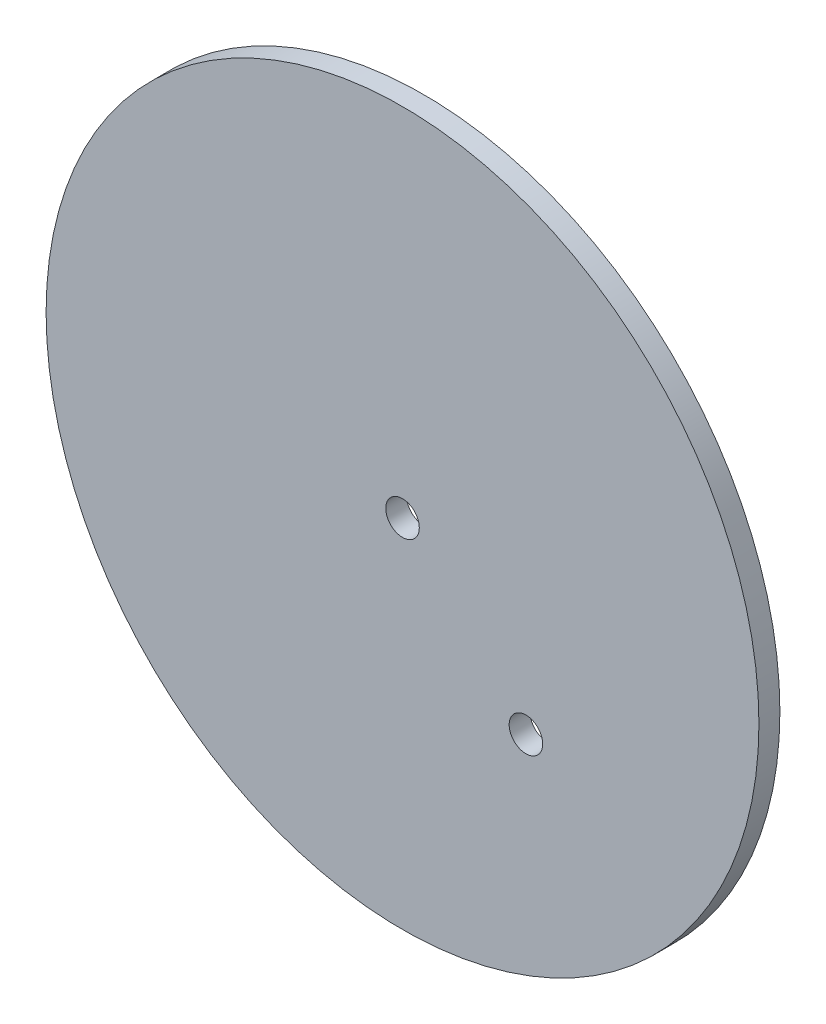
ISO-10303-21;
HEADER;
FILE_DESCRIPTION(('STEP AP214'),'2;1');
FILE_NAME('part.step','',(''),(''),'','','');
FILE_SCHEMA(('AUTOMOTIVE_DESIGN { 1 0 10303 214 1 1 1 1 }'));
ENDSEC;
DATA;
#1=APPLICATION_CONTEXT('core data for automotive mechanical design processes');
#2=APPLICATION_PROTOCOL_DEFINITION('international standard','automotive_design',2000,#1);
#3=PRODUCT_CONTEXT('',#1,'mechanical');
#4=PRODUCT('Part','Part','',(#3));
#5=PRODUCT_RELATED_PRODUCT_CATEGORY('part','',(#4));
#6=PRODUCT_DEFINITION_FORMATION('','',#4);
#7=PRODUCT_DEFINITION_CONTEXT('part definition',#1,'design');
#8=PRODUCT_DEFINITION('design','',#6,#7);
#9=PRODUCT_DEFINITION_SHAPE('','',#8);
#10=(LENGTH_UNIT() NAMED_UNIT(*) SI_UNIT(.MILLI.,.METRE.));
#11=(NAMED_UNIT(*) PLANE_ANGLE_UNIT() SI_UNIT($,.RADIAN.));
#12=(NAMED_UNIT(*) SI_UNIT($,.STERADIAN.) SOLID_ANGLE_UNIT());
#13=UNCERTAINTY_MEASURE_WITH_UNIT(LENGTH_MEASURE(1.E-05),#10,'distance_accuracy_value','');
#14=(GEOMETRIC_REPRESENTATION_CONTEXT(3) GLOBAL_UNCERTAINTY_ASSIGNED_CONTEXT((#13)) GLOBAL_UNIT_ASSIGNED_CONTEXT((#10,
#11,#12)) REPRESENTATION_CONTEXT('',''));
#15=CARTESIAN_POINT('',(0.,0.,0.));
#16=DIRECTION('',(0.,0.,1.));
#17=DIRECTION('',(1.,0.,0.));
#18=AXIS2_PLACEMENT_3D('',#15,#16,#17);
#19=CARTESIAN_POINT('',(0.,0.,-1.25));
#20=DIRECTION('',(0.,0.,1.));
#21=DIRECTION('',(1.,0.,0.));
#22=AXIS2_PLACEMENT_3D('',#19,#20,#21);
#23=CYLINDRICAL_SURFACE('',#22,2.);
#24=CARTESIAN_POINT('',(0.,0.,-1.25));
#25=DIRECTION('',(0.,0.,1.));
#26=DIRECTION('',(1.,0.,0.));
#27=AXIS2_PLACEMENT_3D('',#24,#25,#26);
#28=CIRCLE('',#27,2.);
#29=CARTESIAN_POINT('',(2.,0.,-1.25));
#30=VERTEX_POINT('',#29);
#31=EDGE_CURVE('E43',#30,#30,#28,.T.);
#32=ORIENTED_EDGE('',*,*,#31,.F.);
#33=EDGE_LOOP('',(#32));
#34=FACE_BOUND('',#33,.T.);
#35=CARTESIAN_POINT('',(0.,0.,1.25));
#36=DIRECTION('',(0.,0.,1.));
#37=DIRECTION('',(1.,0.,0.));
#38=AXIS2_PLACEMENT_3D('',#35,#36,#37);
#39=CIRCLE('',#38,2.);
#40=CARTESIAN_POINT('',(2.,0.,1.25));
#41=VERTEX_POINT('',#40);
#42=EDGE_CURVE('E56',#41,#41,#39,.T.);
#43=ORIENTED_EDGE('',*,*,#42,.T.);
#44=EDGE_LOOP('',(#43));
#45=FACE_BOUND('',#44,.T.);
#46=ADVANCED_FACE('F36',(#34,#45),#23,.F.);
#47=CARTESIAN_POINT('',(14.7158150511627,-14.9814814814815,-1.25));
#48=DIRECTION('',(0.,0.,1.));
#49=DIRECTION('',(1.,0.,0.));
#50=AXIS2_PLACEMENT_3D('',#47,#48,#49);
#51=CYLINDRICAL_SURFACE('',#50,2.);
#52=CARTESIAN_POINT('',(14.7158150511627,-14.9814814814815,-1.25));
#53=DIRECTION('',(0.,0.,1.));
#54=DIRECTION('',(1.,0.,0.));
#55=AXIS2_PLACEMENT_3D('',#52,#53,#54);
#56=CIRCLE('',#55,2.);
#57=CARTESIAN_POINT('',(16.7158150511627,-14.9814814814815,-1.25));
#58=VERTEX_POINT('',#57);
#59=EDGE_CURVE('E47',#58,#58,#56,.T.);
#60=ORIENTED_EDGE('',*,*,#59,.F.);
#61=EDGE_LOOP('',(#60));
#62=FACE_BOUND('',#61,.T.);
#63=CARTESIAN_POINT('',(14.7158150511627,-14.9814814814815,1.25));
#64=DIRECTION('',(0.,0.,1.));
#65=DIRECTION('',(1.,0.,0.));
#66=AXIS2_PLACEMENT_3D('',#63,#64,#65);
#67=CIRCLE('',#66,2.);
#68=CARTESIAN_POINT('',(16.7158150511627,-14.9814814814815,1.25));
#69=VERTEX_POINT('',#68);
#70=EDGE_CURVE('E59',#69,#69,#67,.T.);
#71=ORIENTED_EDGE('',*,*,#70,.T.);
#72=EDGE_LOOP('',(#71));
#73=FACE_BOUND('',#72,.T.);
#74=ADVANCED_FACE('F38',(#62,#73),#51,.F.);
#75=CARTESIAN_POINT('',(0.,0.,-1.25));
#76=DIRECTION('',(0.,0.,1.));
#77=DIRECTION('',(1.,0.,0.));
#78=AXIS2_PLACEMENT_3D('',#75,#76,#77);
#79=CYLINDRICAL_SURFACE('',#78,42.5);
#80=CARTESIAN_POINT('',(0.,0.,-1.25));
#81=DIRECTION('',(0.,0.,1.));
#82=DIRECTION('',(1.,0.,0.));
#83=AXIS2_PLACEMENT_3D('',#80,#81,#82);
#84=CIRCLE('',#83,42.5);
#85=CARTESIAN_POINT('',(42.5,0.,-1.25));
#86=VERTEX_POINT('',#85);
#87=EDGE_CURVE('E10',#86,#86,#84,.T.);
#88=ORIENTED_EDGE('',*,*,#87,.T.);
#89=EDGE_LOOP('',(#88));
#90=FACE_BOUND('',#89,.T.);
#91=CARTESIAN_POINT('',(0.,0.,1.25));
#92=DIRECTION('',(0.,0.,1.));
#93=DIRECTION('',(1.,0.,0.));
#94=AXIS2_PLACEMENT_3D('',#91,#92,#93);
#95=CIRCLE('',#94,42.5);
#96=CARTESIAN_POINT('',(42.5,0.,1.25));
#97=VERTEX_POINT('',#96);
#98=EDGE_CURVE('E51',#97,#97,#95,.T.);
#99=ORIENTED_EDGE('',*,*,#98,.F.);
#100=EDGE_LOOP('',(#99));
#101=FACE_BOUND('',#100,.T.);
#102=ADVANCED_FACE('F73',(#90,#101),#79,.T.);
#103=CARTESIAN_POINT('',(0.,0.,-1.25));
#104=DIRECTION('',(0.,0.,1.));
#105=DIRECTION('',(1.,0.,0.));
#106=AXIS2_PLACEMENT_3D('',#103,#104,#105);
#107=PLANE('',#106);
#108=ORIENTED_EDGE('',*,*,#59,.T.);
#109=EDGE_LOOP('',(#108));
#110=FACE_BOUND('',#109,.T.);
#111=ORIENTED_EDGE('',*,*,#31,.T.);
#112=EDGE_LOOP('',(#111));
#113=FACE_BOUND('',#112,.T.);
#114=ORIENTED_EDGE('',*,*,#87,.F.);
#115=EDGE_LOOP('',(#114));
#116=FACE_BOUND('',#115,.T.);
#117=ADVANCED_FACE('F67',(#110,#113,#116),#107,.F.);
#118=CARTESIAN_POINT('',(0.,0.,1.25));
#119=DIRECTION('',(0.,0.,1.));
#120=DIRECTION('',(1.,0.,0.));
#121=AXIS2_PLACEMENT_3D('',#118,#119,#120);
#122=PLANE('',#121);
#123=ORIENTED_EDGE('',*,*,#70,.F.);
#124=EDGE_LOOP('',(#123));
#125=FACE_BOUND('',#124,.T.);
#126=ORIENTED_EDGE('',*,*,#42,.F.);
#127=EDGE_LOOP('',(#126));
#128=FACE_BOUND('',#127,.T.);
#129=ORIENTED_EDGE('',*,*,#98,.T.);
#130=EDGE_LOOP('',(#129));
#131=FACE_BOUND('',#130,.T.);
#132=ADVANCED_FACE('F64',(#125,#128,#131),#122,.T.);
#133=CLOSED_SHELL('',(#46,#74,#102,#117,#132));
#134=MANIFOLD_SOLID_BREP('B2',#133);
#135=ADVANCED_BREP_SHAPE_REPRESENTATION('',(#18,#134),#14);
#136=SHAPE_DEFINITION_REPRESENTATION(#9,#135);
ENDSEC;
END-ISO-10303-21;
